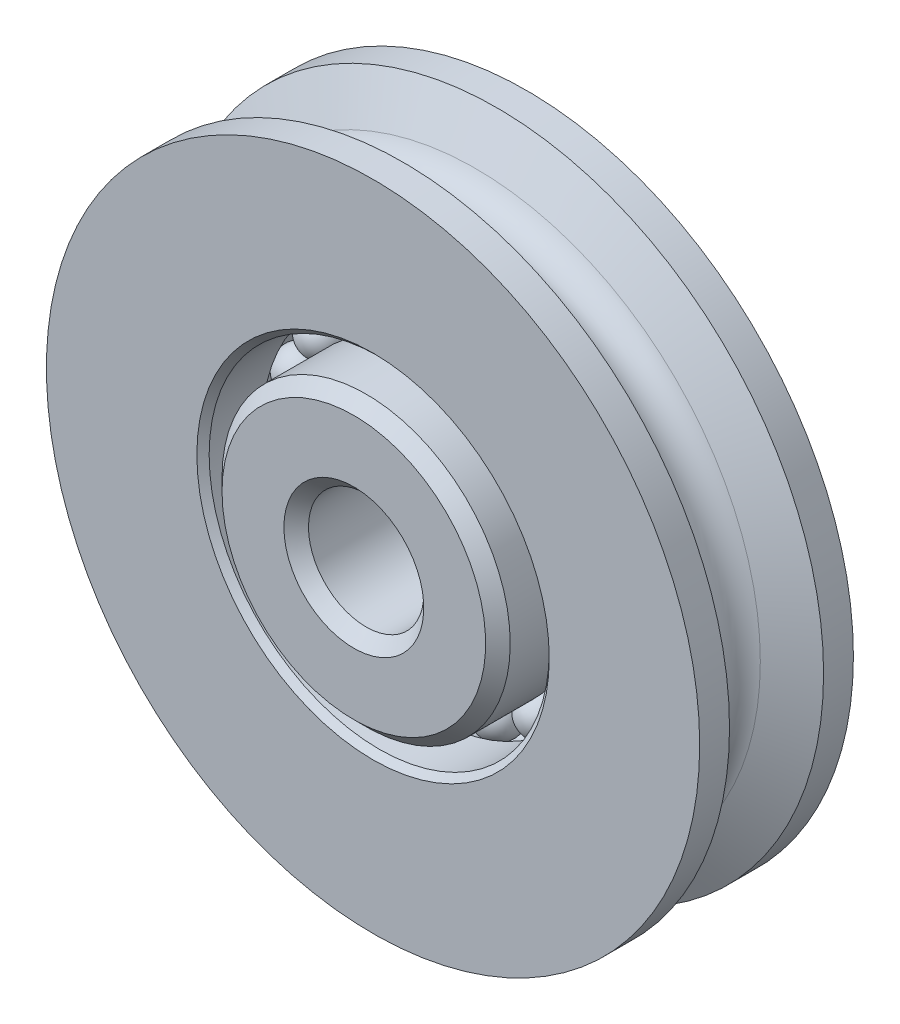
ISO-10303-21;
HEADER;
FILE_DESCRIPTION(('STEP AP214'),'2;1');
FILE_NAME('part.step','',(''),(''),'','','');
FILE_SCHEMA(('AUTOMOTIVE_DESIGN { 1 0 10303 214 1 1 1 1 }'));
ENDSEC;
DATA;
#1=APPLICATION_CONTEXT('core data for automotive mechanical design processes');
#2=APPLICATION_PROTOCOL_DEFINITION('international standard','automotive_design',2000,#1);
#3=PRODUCT_CONTEXT('',#1,'mechanical');
#4=PRODUCT('Part','Part','',(#3));
#5=PRODUCT_RELATED_PRODUCT_CATEGORY('part','',(#4));
#6=PRODUCT_DEFINITION_FORMATION('','',#4);
#7=PRODUCT_DEFINITION_CONTEXT('part definition',#1,'design');
#8=PRODUCT_DEFINITION('design','',#6,#7);
#9=PRODUCT_DEFINITION_SHAPE('','',#8);
#10=(LENGTH_UNIT() NAMED_UNIT(*) SI_UNIT(.MILLI.,.METRE.));
#11=(NAMED_UNIT(*) PLANE_ANGLE_UNIT() SI_UNIT($,.RADIAN.));
#12=(NAMED_UNIT(*) SI_UNIT($,.STERADIAN.) SOLID_ANGLE_UNIT());
#13=UNCERTAINTY_MEASURE_WITH_UNIT(LENGTH_MEASURE(1.E-05),#10,'distance_accuracy_value','');
#14=(GEOMETRIC_REPRESENTATION_CONTEXT(3) GLOBAL_UNCERTAINTY_ASSIGNED_CONTEXT((#13)) GLOBAL_UNIT_ASSIGNED_CONTEXT((#10,
#11,#12)) REPRESENTATION_CONTEXT('',''));
#15=CARTESIAN_POINT('',(0.,0.,0.));
#16=DIRECTION('',(0.,0.,1.));
#17=DIRECTION('',(1.,0.,0.));
#18=AXIS2_PLACEMENT_3D('',#15,#16,#17);
#19=CARTESIAN_POINT('',(2.00518230615573,6.17131657269088,0.));
#20=DIRECTION('',(0.309016994374935,0.951056516295158,0.));
#21=DIRECTION('',(0.,0.,-1.));
#22=AXIS2_PLACEMENT_3D('',#19,#20,#21);
#23=SPHERICAL_SURFACE('',#22,0.89296875);
#24=CARTESIAN_POINT('',(2.28112482535147,7.02058032122632,0.));
#25=VERTEX_POINT('',#24);
#26=VERTEX_LOOP('',#25);
#27=FACE_BOUND('',#26,.T.);
#28=ADVANCED_FACE('F39',(#27),#23,.T.);
#29=CLOSED_SHELL('',(#28));
#30=MANIFOLD_SOLID_BREP('B2',#29);
#31=CARTESIAN_POINT('',(3.81408339725839,5.24963543115586,0.));
#32=DIRECTION('',(0.587785252292462,0.809016994374955,0.));
#33=DIRECTION('',(0.,0.,-1.));
#34=AXIS2_PLACEMENT_3D('',#31,#32,#33);
#35=SPHERICAL_SURFACE('',#34,0.89296875);
#36=CARTESIAN_POINT('',(4.33895725926642,5.97206232535162,0.));
#37=VERTEX_POINT('',#36);
#38=VERTEX_LOOP('',#37);
#39=FACE_BOUND('',#38,.T.);
#40=ADVANCED_FACE('F57',(#39),#35,.T.);
#41=CLOSED_SHELL('',(#40));
#42=MANIFOLD_SOLID_BREP('B6',#41);
#43=CARTESIAN_POINT('',(5.24963543115576,3.81408339725852,0.));
#44=DIRECTION('',(0.80901699437494,0.587785252292483,0.));
#45=DIRECTION('',(0.,0.,-1.));
#46=AXIS2_PLACEMENT_3D('',#43,#44,#45);
#47=SPHERICAL_SURFACE('',#46,0.89296875);
#48=CARTESIAN_POINT('',(5.97206232535151,4.33895725926657,0.));
#49=VERTEX_POINT('',#48);
#50=VERTEX_LOOP('',#49);
#51=FACE_BOUND('',#50,.T.);
#52=ADVANCED_FACE('F75',(#51),#47,.T.);
#53=CLOSED_SHELL('',(#52));
#54=MANIFOLD_SOLID_BREP('B35',#53);
#55=CARTESIAN_POINT('',(6.17131657269083,2.00518230615588,0.));
#56=DIRECTION('',(0.95105651629515,0.309016994374958,0.));
#57=DIRECTION('',(0.,0.,-1.));
#58=AXIS2_PLACEMENT_3D('',#55,#56,#57);
#59=SPHERICAL_SURFACE('',#58,0.89296875);
#60=CARTESIAN_POINT('',(7.02058032122626,2.28112482535164,0.));
#61=VERTEX_POINT('',#60);
#62=VERTEX_LOOP('',#61);
#63=FACE_BOUND('',#62,.T.);
#64=ADVANCED_FACE('F93',(#63),#59,.T.);
#65=CLOSED_SHELL('',(#64));
#66=MANIFOLD_SOLID_BREP('B53',#65);
#67=CARTESIAN_POINT('',(6.48890625,0.,0.));
#68=DIRECTION('',(1.,0.,0.));
#69=DIRECTION('',(0.,0.,-1.));
#70=AXIS2_PLACEMENT_3D('',#67,#68,#69);
#71=SPHERICAL_SURFACE('',#70,0.89296875);
#72=CARTESIAN_POINT('',(7.381875,0.,0.));
#73=VERTEX_POINT('',#72);
#74=VERTEX_LOOP('',#73);
#75=FACE_BOUND('',#74,.T.);
#76=ADVANCED_FACE('F111',(#75),#71,.T.);
#77=CLOSED_SHELL('',(#76));
#78=MANIFOLD_SOLID_BREP('B71',#77);
#79=CARTESIAN_POINT('',(6.17131657269087,-2.00518230615575,0.));
#80=DIRECTION('',(0.951056516295157,-0.309016994374938,0.));
#81=DIRECTION('',(0.,0.,-1.));
#82=AXIS2_PLACEMENT_3D('',#79,#80,#81);
#83=SPHERICAL_SURFACE('',#82,0.89296875);
#84=CARTESIAN_POINT('',(7.02058032122631,-2.2811248253515,0.));
#85=VERTEX_POINT('',#84);
#86=VERTEX_LOOP('',#85);
#87=FACE_BOUND('',#86,.T.);
#88=ADVANCED_FACE('F129',(#87),#83,.T.);
#89=CLOSED_SHELL('',(#88));
#90=MANIFOLD_SOLID_BREP('B89',#89);
#91=CARTESIAN_POINT('',(5.24963543115585,-3.81408339725841,0.));
#92=DIRECTION('',(0.809016994374953,-0.587785252292465,0.));
#93=DIRECTION('',(0.,0.,-1.));
#94=AXIS2_PLACEMENT_3D('',#91,#92,#93);
#95=SPHERICAL_SURFACE('',#94,0.89296875);
#96=CARTESIAN_POINT('',(5.97206232535161,-4.33895725926644,0.));
#97=VERTEX_POINT('',#96);
#98=VERTEX_LOOP('',#97);
#99=FACE_BOUND('',#98,.T.);
#100=ADVANCED_FACE('F147',(#99),#95,.T.);
#101=CLOSED_SHELL('',(#100));
#102=MANIFOLD_SOLID_BREP('B107',#101);
#103=CARTESIAN_POINT('',(3.8140833972585,-5.24963543115578,0.));
#104=DIRECTION('',(0.58778525229248,-0.809016994374942,0.));
#105=DIRECTION('',(0.,0.,-1.));
#106=AXIS2_PLACEMENT_3D('',#103,#104,#105);
#107=SPHERICAL_SURFACE('',#106,0.89296875);
#108=CARTESIAN_POINT('',(4.33895725926655,-5.97206232535153,0.));
#109=VERTEX_POINT('',#108);
#110=VERTEX_LOOP('',#109);
#111=FACE_BOUND('',#110,.T.);
#112=ADVANCED_FACE('F165',(#111),#107,.T.);
#113=CLOSED_SHELL('',(#112));
#114=MANIFOLD_SOLID_BREP('B125',#113);
#115=CARTESIAN_POINT('',(2.00518230615586,-6.17131657269083,0.));
#116=DIRECTION('',(0.309016994374955,-0.951056516295151,0.));
#117=DIRECTION('',(0.,0.,-1.));
#118=AXIS2_PLACEMENT_3D('',#115,#116,#117);
#119=SPHERICAL_SURFACE('',#118,0.89296875);
#120=CARTESIAN_POINT('',(2.28112482535162,-7.02058032122627,0.));
#121=VERTEX_POINT('',#120);
#122=VERTEX_LOOP('',#121);
#123=FACE_BOUND('',#122,.T.);
#124=ADVANCED_FACE('F183',(#123),#119,.T.);
#125=CLOSED_SHELL('',(#124));
#126=MANIFOLD_SOLID_BREP('B143',#125);
#127=CARTESIAN_POINT('',(0.,-6.48890625,0.));
#128=DIRECTION('',(0.,-1.,0.));
#129=DIRECTION('',(0.,0.,-1.));
#130=AXIS2_PLACEMENT_3D('',#127,#128,#129);
#131=SPHERICAL_SURFACE('',#130,0.89296875);
#132=CARTESIAN_POINT('',(0.,-7.381875,0.));
#133=VERTEX_POINT('',#132);
#134=VERTEX_LOOP('',#133);
#135=FACE_BOUND('',#134,.T.);
#136=ADVANCED_FACE('F201',(#135),#131,.T.);
#137=CLOSED_SHELL('',(#136));
#138=MANIFOLD_SOLID_BREP('B161',#137);
#139=CARTESIAN_POINT('',(-2.00518230615577,-6.17131657269086,0.));
#140=DIRECTION('',(-0.309016994374941,-0.951056516295156,0.));
#141=DIRECTION('',(0.,0.,-1.));
#142=AXIS2_PLACEMENT_3D('',#139,#140,#141);
#143=SPHERICAL_SURFACE('',#142,0.89296875);
#144=CARTESIAN_POINT('',(-2.28112482535152,-7.0205803212263,0.));
#145=VERTEX_POINT('',#144);
#146=VERTEX_LOOP('',#145);
#147=FACE_BOUND('',#146,.T.);
#148=ADVANCED_FACE('F219',(#147),#143,.T.);
#149=CLOSED_SHELL('',(#148));
#150=MANIFOLD_SOLID_BREP('B179',#149);
#151=CARTESIAN_POINT('',(-3.81408339725843,-5.24963543115583,0.));
#152=DIRECTION('',(-0.587785252292469,-0.809016994374951,0.));
#153=DIRECTION('',(0.,0.,-1.));
#154=AXIS2_PLACEMENT_3D('',#151,#152,#153);
#155=SPHERICAL_SURFACE('',#154,0.89296875);
#156=CARTESIAN_POINT('',(-4.33895725926647,-5.97206232535159,0.));
#157=VERTEX_POINT('',#156);
#158=VERTEX_LOOP('',#157);
#159=FACE_BOUND('',#158,.T.);
#160=ADVANCED_FACE('F237',(#159),#155,.T.);
#161=CLOSED_SHELL('',(#160));
#162=MANIFOLD_SOLID_BREP('B197',#161);
#163=CARTESIAN_POINT('',(-5.24963543115579,-3.81408339725848,0.));
#164=DIRECTION('',(-0.809016994374945,-0.587785252292477,0.));
#165=DIRECTION('',(0.,0.,-1.));
#166=AXIS2_PLACEMENT_3D('',#163,#164,#165);
#167=SPHERICAL_SURFACE('',#166,0.89296875);
#168=CARTESIAN_POINT('',(-5.97206232535154,-4.33895725926653,0.));
#169=VERTEX_POINT('',#168);
#170=VERTEX_LOOP('',#169);
#171=FACE_BOUND('',#170,.T.);
#172=ADVANCED_FACE('F255',(#171),#167,.T.);
#173=CLOSED_SHELL('',(#172));
#174=MANIFOLD_SOLID_BREP('B215',#173);
#175=CARTESIAN_POINT('',(-6.17131657269084,-2.00518230615584,0.));
#176=DIRECTION('',(-0.951056516295152,-0.309016994374952,0.));
#177=DIRECTION('',(0.,0.,-1.));
#178=AXIS2_PLACEMENT_3D('',#175,#176,#177);
#179=SPHERICAL_SURFACE('',#178,0.89296875);
#180=CARTESIAN_POINT('',(-7.02058032122628,-2.2811248253516,0.));
#181=VERTEX_POINT('',#180);
#182=VERTEX_LOOP('',#181);
#183=FACE_BOUND('',#182,.T.);
#184=ADVANCED_FACE('F273',(#183),#179,.T.);
#185=CLOSED_SHELL('',(#184));
#186=MANIFOLD_SOLID_BREP('B233',#185);
#187=CARTESIAN_POINT('',(-6.48890625,0.,0.));
#188=DIRECTION('',(-1.,0.,0.));
#189=DIRECTION('',(0.,0.,-1.));
#190=AXIS2_PLACEMENT_3D('',#187,#188,#189);
#191=SPHERICAL_SURFACE('',#190,0.89296875);
#192=CARTESIAN_POINT('',(-7.381875,0.,0.));
#193=VERTEX_POINT('',#192);
#194=VERTEX_LOOP('',#193);
#195=FACE_BOUND('',#194,.T.);
#196=ADVANCED_FACE('F291',(#195),#191,.T.);
#197=CLOSED_SHELL('',(#196));
#198=MANIFOLD_SOLID_BREP('B251',#197);
#199=CARTESIAN_POINT('',(-6.17131657269086,2.00518230615579,0.));
#200=DIRECTION('',(-0.951056516295155,0.309016994374945,0.));
#201=DIRECTION('',(0.,0.,-1.));
#202=AXIS2_PLACEMENT_3D('',#199,#200,#201);
#203=SPHERICAL_SURFACE('',#202,0.89296875);
#204=CARTESIAN_POINT('',(-7.02058032122629,2.28112482535155,0.));
#205=VERTEX_POINT('',#204);
#206=VERTEX_LOOP('',#205);
#207=FACE_BOUND('',#206,.T.);
#208=ADVANCED_FACE('F309',(#207),#203,.T.);
#209=CLOSED_SHELL('',(#208));
#210=MANIFOLD_SOLID_BREP('B269',#209);
#211=CARTESIAN_POINT('',(-5.24963543115582,3.81408339725844,0.));
#212=DIRECTION('',(-0.809016994374949,0.587785252292471,0.));
#213=DIRECTION('',(0.,0.,-1.));
#214=AXIS2_PLACEMENT_3D('',#211,#212,#213);
#215=SPHERICAL_SURFACE('',#214,0.89296875);
#216=CARTESIAN_POINT('',(-5.97206232535157,4.33895725926649,0.));
#217=VERTEX_POINT('',#216);
#218=VERTEX_LOOP('',#217);
#219=FACE_BOUND('',#218,.T.);
#220=ADVANCED_FACE('F327',(#219),#215,.T.);
#221=CLOSED_SHELL('',(#220));
#222=MANIFOLD_SOLID_BREP('B287',#221);
#223=CARTESIAN_POINT('',(-3.81408339725846,5.24963543115581,0.));
#224=DIRECTION('',(-0.587785252292474,0.809016994374947,0.));
#225=DIRECTION('',(0.,0.,-1.));
#226=AXIS2_PLACEMENT_3D('',#223,#224,#225);
#227=SPHERICAL_SURFACE('',#226,0.89296875);
#228=CARTESIAN_POINT('',(-4.33895725926651,5.97206232535156,0.));
#229=VERTEX_POINT('',#228);
#230=VERTEX_LOOP('',#229);
#231=FACE_BOUND('',#230,.T.);
#232=ADVANCED_FACE('F345',(#231),#227,.T.);
#233=CLOSED_SHELL('',(#232));
#234=MANIFOLD_SOLID_BREP('B305',#233);
#235=CARTESIAN_POINT('',(-2.00518230615582,6.17131657269085,0.));
#236=DIRECTION('',(-0.309016994374948,0.951056516295154,0.));
#237=DIRECTION('',(0.,0.,-1.));
#238=AXIS2_PLACEMENT_3D('',#235,#236,#237);
#239=SPHERICAL_SURFACE('',#238,0.89296875);
#240=CARTESIAN_POINT('',(-2.28112482535157,7.02058032122629,0.));
#241=VERTEX_POINT('',#240);
#242=VERTEX_LOOP('',#241);
#243=FACE_BOUND('',#242,.T.);
#244=ADVANCED_FACE('F363',(#243),#239,.T.);
#245=CLOSED_SHELL('',(#244));
#246=MANIFOLD_SOLID_BREP('B323',#245);
#247=CARTESIAN_POINT('',(0.,6.48890625,0.));
#248=DIRECTION('',(0.,1.,0.));
#249=DIRECTION('',(0.,0.,-1.));
#250=AXIS2_PLACEMENT_3D('',#247,#248,#249);
#251=SPHERICAL_SURFACE('',#250,0.89296875);
#252=CARTESIAN_POINT('',(0.,7.381875,0.));
#253=VERTEX_POINT('',#252);
#254=VERTEX_LOOP('',#253);
#255=FACE_BOUND('',#254,.T.);
#256=ADVANCED_FACE('F383',(#255),#251,.T.);
#257=CLOSED_SHELL('',(#256));
#258=MANIFOLD_SOLID_BREP('B341',#257);
#259=CARTESIAN_POINT('',(0.,5.953125,3.96875));
#260=DIRECTION('',(0.,0.,-1.));
#261=DIRECTION('',(-1.,0.,0.));
#262=AXIS2_PLACEMENT_3D('',#259,#260,#261);
#263=PLANE('',#262);
#264=CARTESIAN_POINT('',(0.,0.,3.96875));
#265=DIRECTION('',(0.,0.,-1.));
#266=DIRECTION('',(-1.,0.,0.));
#267=AXIS2_PLACEMENT_3D('',#264,#265,#266);
#268=CIRCLE('',#267,5.445125);
#269=CARTESIAN_POINT('',(-5.445125,0.,3.96875));
#270=VERTEX_POINT('',#269);
#271=EDGE_CURVE('E409',#270,#270,#268,.F.);
#272=ORIENTED_EDGE('',*,*,#271,.T.);
#273=EDGE_LOOP('',(#272));
#274=FACE_BOUND('',#273,.T.);
#275=CARTESIAN_POINT('',(0.,0.,3.96875));
#276=DIRECTION('',(0.,0.,-1.));
#277=DIRECTION('',(-1.,0.,0.));
#278=AXIS2_PLACEMENT_3D('',#275,#276,#277);
#279=CIRCLE('',#278,2.88925);
#280=CARTESIAN_POINT('',(-2.88925,0.,3.96875));
#281=VERTEX_POINT('',#280);
#282=EDGE_CURVE('E413',#281,#281,#279,.T.);
#283=ORIENTED_EDGE('',*,*,#282,.T.);
#284=EDGE_LOOP('',(#283));
#285=FACE_BOUND('',#284,.T.);
#286=ADVANCED_FACE('F402',(#274,#285),#263,.F.);
#287=CARTESIAN_POINT('',(0.,0.,3.96875));
#288=DIRECTION('',(0.,0.,1.));
#289=DIRECTION('',(1.,0.,0.));
#290=AXIS2_PLACEMENT_3D('',#287,#288,#289);
#291=CYLINDRICAL_SURFACE('',#290,2.38125);
#292=CARTESIAN_POINT('',(0.,0.,-3.46075));
#293=DIRECTION('',(0.,0.,1.));
#294=DIRECTION('',(1.,0.,0.));
#295=AXIS2_PLACEMENT_3D('',#292,#293,#294);
#296=CIRCLE('',#295,2.38125);
#297=CARTESIAN_POINT('',(2.38125,0.,-3.46075));
#298=VERTEX_POINT('',#297);
#299=EDGE_CURVE('E422',#298,#298,#296,.F.);
#300=ORIENTED_EDGE('',*,*,#299,.T.);
#301=EDGE_LOOP('',(#300));
#302=FACE_BOUND('',#301,.T.);
#303=CARTESIAN_POINT('',(0.,0.,3.46075));
#304=DIRECTION('',(0.,0.,-1.));
#305=DIRECTION('',(-1.,0.,0.));
#306=AXIS2_PLACEMENT_3D('',#303,#304,#305);
#307=CIRCLE('',#306,2.38125);
#308=CARTESIAN_POINT('',(-2.38125,0.,3.46075));
#309=VERTEX_POINT('',#308);
#310=EDGE_CURVE('E425',#309,#309,#307,.F.);
#311=ORIENTED_EDGE('',*,*,#310,.T.);
#312=EDGE_LOOP('',(#311));
#313=FACE_BOUND('',#312,.T.);
#314=ADVANCED_FACE('F457',(#302,#313),#291,.F.);
#315=CARTESIAN_POINT('',(0.,5.953125,-3.96875));
#316=DIRECTION('',(0.,0.,1.));
#317=DIRECTION('',(1.,0.,0.));
#318=AXIS2_PLACEMENT_3D('',#315,#316,#317);
#319=PLANE('',#318);
#320=CARTESIAN_POINT('',(0.,0.,-3.96875));
#321=DIRECTION('',(0.,0.,1.));
#322=DIRECTION('',(1.,0.,0.));
#323=AXIS2_PLACEMENT_3D('',#320,#321,#322);
#324=CIRCLE('',#323,2.88925);
#325=CARTESIAN_POINT('',(2.88925,0.,-3.96875));
#326=VERTEX_POINT('',#325);
#327=EDGE_CURVE('E428',#326,#326,#324,.T.);
#328=ORIENTED_EDGE('',*,*,#327,.T.);
#329=EDGE_LOOP('',(#328));
#330=FACE_BOUND('',#329,.T.);
#331=CARTESIAN_POINT('',(0.,0.,-3.96875));
#332=DIRECTION('',(0.,0.,1.));
#333=DIRECTION('',(1.,0.,0.));
#334=AXIS2_PLACEMENT_3D('',#331,#332,#333);
#335=CIRCLE('',#334,5.44512499999999);
#336=CARTESIAN_POINT('',(5.44512499999999,0.,-3.96875));
#337=VERTEX_POINT('',#336);
#338=EDGE_CURVE('E431',#337,#337,#335,.F.);
#339=ORIENTED_EDGE('',*,*,#338,.T.);
#340=EDGE_LOOP('',(#339));
#341=FACE_BOUND('',#340,.T.);
#342=ADVANCED_FACE('F451',(#330,#341),#319,.F.);
#343=CARTESIAN_POINT('',(0.,0.,3.96875));
#344=DIRECTION('',(0.,0.,1.));
#345=DIRECTION('',(1.,0.,0.));
#346=AXIS2_PLACEMENT_3D('',#343,#344,#345);
#347=CYLINDRICAL_SURFACE('',#346,5.953125);
#348=CARTESIAN_POINT('',(0.,0.,-3.46075));
#349=DIRECTION('',(0.,0.,1.));
#350=DIRECTION('',(1.,0.,0.));
#351=AXIS2_PLACEMENT_3D('',#348,#349,#350);
#352=CIRCLE('',#351,5.953125);
#353=CARTESIAN_POINT('',(5.953125,0.,-3.46075));
#354=VERTEX_POINT('',#353);
#355=EDGE_CURVE('E417',#354,#354,#352,.T.);
#356=ORIENTED_EDGE('',*,*,#355,.T.);
#357=EDGE_LOOP('',(#356));
#358=FACE_BOUND('',#357,.T.);
#359=CARTESIAN_POINT('',(0.,0.,-0.714375));
#360=DIRECTION('',(0.,0.,1.));
#361=DIRECTION('',(1.,0.,0.));
#362=AXIS2_PLACEMENT_3D('',#359,#360,#361);
#363=CIRCLE('',#362,5.953125);
#364=CARTESIAN_POINT('',(5.953125,0.,-0.714375));
#365=VERTEX_POINT('',#364);
#366=EDGE_CURVE('E434',#365,#365,#363,.T.);
#367=ORIENTED_EDGE('',*,*,#366,.F.);
#368=EDGE_LOOP('',(#367));
#369=FACE_BOUND('',#368,.T.);
#370=ADVANCED_FACE('F446',(#358,#369),#347,.T.);
#371=CARTESIAN_POINT('',(0.,0.,0.));
#372=DIRECTION('',(0.,0.,1.));
#373=DIRECTION('',(1.,0.,0.));
#374=AXIS2_PLACEMENT_3D('',#371,#372,#373);
#375=TOROIDAL_SURFACE('',#374,6.48890625,0.89296875);
#376=CARTESIAN_POINT('',(0.,0.,0.714375));
#377=DIRECTION('',(0.,0.,1.));
#378=DIRECTION('',(1.,0.,0.));
#379=AXIS2_PLACEMENT_3D('',#376,#377,#378);
#380=CIRCLE('',#379,5.953125);
#381=CARTESIAN_POINT('',(5.953125,0.,0.714375));
#382=VERTEX_POINT('',#381);
#383=EDGE_CURVE('E437',#382,#382,#380,.T.);
#384=ORIENTED_EDGE('',*,*,#383,.F.);
#385=EDGE_LOOP('',(#384));
#386=FACE_BOUND('',#385,.T.);
#387=ORIENTED_EDGE('',*,*,#366,.T.);
#388=EDGE_LOOP('',(#387));
#389=FACE_BOUND('',#388,.T.);
#390=ADVANCED_FACE('F443',(#386,#389),#375,.F.);
#391=CARTESIAN_POINT('',(0.,0.,3.96875));
#392=DIRECTION('',(0.,0.,1.));
#393=DIRECTION('',(1.,0.,0.));
#394=AXIS2_PLACEMENT_3D('',#391,#392,#393);
#395=CYLINDRICAL_SURFACE('',#394,5.953125);
#396=CARTESIAN_POINT('',(0.,0.,3.46075));
#397=DIRECTION('',(0.,0.,-1.));
#398=DIRECTION('',(-1.,0.,0.));
#399=AXIS2_PLACEMENT_3D('',#396,#397,#398);
#400=CIRCLE('',#399,5.953125);
#401=CARTESIAN_POINT('',(-5.953125,0.,3.46075));
#402=VERTEX_POINT('',#401);
#403=EDGE_CURVE('E382',#402,#402,#400,.T.);
#404=ORIENTED_EDGE('',*,*,#403,.T.);
#405=EDGE_LOOP('',(#404));
#406=FACE_BOUND('',#405,.T.);
#407=ORIENTED_EDGE('',*,*,#383,.T.);
#408=EDGE_LOOP('',(#407));
#409=FACE_BOUND('',#408,.T.);
#410=ADVANCED_FACE('F441',(#406,#409),#395,.T.);
#411=CARTESIAN_POINT('',(0.,0.,-3.96875));
#412=DIRECTION('',(0.,0.,-1.));
#413=DIRECTION('',(-1.,0.,0.));
#414=AXIS2_PLACEMENT_3D('',#411,#412,#413);
#415=CONICAL_SURFACE('',#414,2.88925,0.785398163397447);
#416=ORIENTED_EDGE('',*,*,#299,.F.);
#417=EDGE_LOOP('',(#416));
#418=FACE_BOUND('',#417,.T.);
#419=ORIENTED_EDGE('',*,*,#327,.F.);
#420=EDGE_LOOP('',(#419));
#421=FACE_BOUND('',#420,.T.);
#422=ADVANCED_FACE('F469',(#418,#421),#415,.F.);
#423=CARTESIAN_POINT('',(0.,0.,-3.46075));
#424=DIRECTION('',(0.,0.,1.));
#425=DIRECTION('',(1.,0.,0.));
#426=AXIS2_PLACEMENT_3D('',#423,#424,#425);
#427=CONICAL_SURFACE('',#426,5.953125,0.785398163397452);
#428=ORIENTED_EDGE('',*,*,#338,.F.);
#429=EDGE_LOOP('',(#428));
#430=FACE_BOUND('',#429,.T.);
#431=ORIENTED_EDGE('',*,*,#355,.F.);
#432=EDGE_LOOP('',(#431));
#433=FACE_BOUND('',#432,.T.);
#434=ADVANCED_FACE('F472',(#430,#433),#427,.T.);
#435=CARTESIAN_POINT('',(0.,0.,3.96875));
#436=DIRECTION('',(0.,0.,-1.));
#437=DIRECTION('',(-1.,0.,0.));
#438=AXIS2_PLACEMENT_3D('',#435,#436,#437);
#439=CONICAL_SURFACE('',#438,5.445125,0.785398163397447);
#440=ORIENTED_EDGE('',*,*,#403,.F.);
#441=EDGE_LOOP('',(#440));
#442=FACE_BOUND('',#441,.T.);
#443=ORIENTED_EDGE('',*,*,#271,.F.);
#444=EDGE_LOOP('',(#443));
#445=FACE_BOUND('',#444,.T.);
#446=ADVANCED_FACE('F475',(#442,#445),#439,.T.);
#447=CARTESIAN_POINT('',(0.,0.,3.46075));
#448=DIRECTION('',(0.,0.,1.));
#449=DIRECTION('',(1.,0.,0.));
#450=AXIS2_PLACEMENT_3D('',#447,#448,#449);
#451=CONICAL_SURFACE('',#450,2.38125,0.785398163397445);
#452=ORIENTED_EDGE('',*,*,#282,.F.);
#453=EDGE_LOOP('',(#452));
#454=FACE_BOUND('',#453,.T.);
#455=ORIENTED_EDGE('',*,*,#310,.F.);
#456=EDGE_LOOP('',(#455));
#457=FACE_BOUND('',#456,.T.);
#458=ADVANCED_FACE('F404',(#454,#457),#451,.F.);
#459=CLOSED_SHELL('',(#286,#314,#342,#370,#390,#410,#422,#434,#446,#458));
#460=MANIFOLD_SOLID_BREP('B359',#459);
#461=CARTESIAN_POINT('',(0.,0.,0.));
#462=DIRECTION('',(0.,0.,1.));
#463=DIRECTION('',(1.,0.,0.));
#464=AXIS2_PLACEMENT_3D('',#461,#462,#463);
#465=TOROIDAL_SURFACE('',#464,12.303125,1.190625);
#466=CARTESIAN_POINT('',(0.,0.,1.06081086983107));
#467=DIRECTION('',(0.,0.,1.));
#468=DIRECTION('',(1.,0.,0.));
#469=AXIS2_PLACEMENT_3D('',#466,#467,#468);
#470=CIRCLE('',#469,11.7625066604357);
#471=CARTESIAN_POINT('',(11.7625066604357,0.,1.06081086983107));
#472=VERTEX_POINT('',#471);
#473=EDGE_CURVE('E573',#472,#472,#470,.T.);
#474=ORIENTED_EDGE('',*,*,#473,.F.);
#475=EDGE_LOOP('',(#474));
#476=FACE_BOUND('',#475,.T.);
#477=CARTESIAN_POINT('',(0.,0.,-1.06081086983107));
#478=DIRECTION('',(0.,0.,1.));
#479=DIRECTION('',(1.,0.,0.));
#480=AXIS2_PLACEMENT_3D('',#477,#478,#479);
#481=CIRCLE('',#480,11.7625066604357);
#482=CARTESIAN_POINT('',(11.7625066604357,0.,-1.06081086983107));
#483=VERTEX_POINT('',#482);
#484=EDGE_CURVE('E594',#483,#483,#481,.T.);
#485=ORIENTED_EDGE('',*,*,#484,.T.);
#486=EDGE_LOOP('',(#485));
#487=FACE_BOUND('',#486,.T.);
#488=ADVANCED_FACE('F553',(#476,#487),#465,.F.);
#489=CARTESIAN_POINT('',(0.,0.,1.06081086983107));
#490=DIRECTION('',(0.,0.,1.));
#491=DIRECTION('',(1.,0.,0.));
#492=AXIS2_PLACEMENT_3D('',#489,#490,#491);
#493=CONICAL_SURFACE('',#492,11.7625066604357,1.0994764538701);
#494=CARTESIAN_POINT('',(0.,0.,1.9431));
#495=DIRECTION('',(0.,0.,1.));
#496=DIRECTION('',(1.,0.,0.));
#497=AXIS2_PLACEMENT_3D('',#494,#495,#496);
#498=CIRCLE('',#497,13.49375);
#499=CARTESIAN_POINT('',(13.49375,0.,1.9431));
#500=VERTEX_POINT('',#499);
#501=EDGE_CURVE('E576',#500,#500,#498,.T.);
#502=ORIENTED_EDGE('',*,*,#501,.F.);
#503=EDGE_LOOP('',(#502));
#504=FACE_BOUND('',#503,.T.);
#505=ORIENTED_EDGE('',*,*,#473,.T.);
#506=EDGE_LOOP('',(#505));
#507=FACE_BOUND('',#506,.T.);
#508=ADVANCED_FACE('F624',(#504,#507),#493,.T.);
#509=CARTESIAN_POINT('',(0.,0.,3.96875));
#510=DIRECTION('',(0.,0.,1.));
#511=DIRECTION('',(1.,0.,0.));
#512=AXIS2_PLACEMENT_3D('',#509,#510,#511);
#513=CYLINDRICAL_SURFACE('',#512,13.49375);
#514=CARTESIAN_POINT('',(0.,0.,3.175));
#515=DIRECTION('',(0.,0.,1.));
#516=DIRECTION('',(1.,0.,0.));
#517=AXIS2_PLACEMENT_3D('',#514,#515,#516);
#518=CIRCLE('',#517,13.49375);
#519=CARTESIAN_POINT('',(13.49375,0.,3.175));
#520=VERTEX_POINT('',#519);
#521=EDGE_CURVE('E579',#520,#520,#518,.T.);
#522=ORIENTED_EDGE('',*,*,#521,.F.);
#523=EDGE_LOOP('',(#522));
#524=FACE_BOUND('',#523,.T.);
#525=ORIENTED_EDGE('',*,*,#501,.T.);
#526=EDGE_LOOP('',(#525));
#527=FACE_BOUND('',#526,.T.);
#528=ADVANCED_FACE('F630',(#524,#527),#513,.T.);
#529=CARTESIAN_POINT('',(0.,7.0246875,3.175));
#530=DIRECTION('',(0.,0.,-1.));
#531=DIRECTION('',(-1.,0.,0.));
#532=AXIS2_PLACEMENT_3D('',#529,#530,#531);
#533=PLANE('',#532);
#534=CARTESIAN_POINT('',(0.,0.,3.175));
#535=DIRECTION('',(0.,0.,-1.));
#536=DIRECTION('',(-1.,0.,0.));
#537=AXIS2_PLACEMENT_3D('',#534,#535,#536);
#538=CIRCLE('',#537,7.2786875);
#539=CARTESIAN_POINT('',(-7.2786875,0.,3.175));
#540=VERTEX_POINT('',#539);
#541=EDGE_CURVE('E401',#540,#540,#538,.T.);
#542=ORIENTED_EDGE('',*,*,#541,.T.);
#543=EDGE_LOOP('',(#542));
#544=FACE_BOUND('',#543,.T.);
#545=ORIENTED_EDGE('',*,*,#521,.T.);
#546=EDGE_LOOP('',(#545));
#547=FACE_BOUND('',#546,.T.);
#548=ADVANCED_FACE('F654',(#544,#547),#533,.F.);
#549=CARTESIAN_POINT('',(0.,0.,3.96875));
#550=DIRECTION('',(0.,0.,1.));
#551=DIRECTION('',(1.,0.,0.));
#552=AXIS2_PLACEMENT_3D('',#549,#550,#551);
#553=CYLINDRICAL_SURFACE('',#552,7.0246875);
#554=CARTESIAN_POINT('',(0.,0.,2.921));
#555=DIRECTION('',(0.,0.,-1.));
#556=DIRECTION('',(-1.,0.,0.));
#557=AXIS2_PLACEMENT_3D('',#554,#555,#556);
#558=CIRCLE('',#557,7.0246875);
#559=CARTESIAN_POINT('',(-7.0246875,0.,2.921));
#560=VERTEX_POINT('',#559);
#561=EDGE_CURVE('E560',#560,#560,#558,.F.);
#562=ORIENTED_EDGE('',*,*,#561,.T.);
#563=EDGE_LOOP('',(#562));
#564=FACE_BOUND('',#563,.T.);
#565=CARTESIAN_POINT('',(0.,0.,0.714375));
#566=DIRECTION('',(0.,0.,1.));
#567=DIRECTION('',(1.,0.,0.));
#568=AXIS2_PLACEMENT_3D('',#565,#566,#567);
#569=CIRCLE('',#568,7.0246875);
#570=CARTESIAN_POINT('',(7.0246875,0.,0.714375));
#571=VERTEX_POINT('',#570);
#572=EDGE_CURVE('E582',#571,#571,#569,.T.);
#573=ORIENTED_EDGE('',*,*,#572,.F.);
#574=EDGE_LOOP('',(#573));
#575=FACE_BOUND('',#574,.T.);
#576=ADVANCED_FACE('F649',(#564,#575),#553,.F.);
#577=CARTESIAN_POINT('',(0.,0.,0.));
#578=DIRECTION('',(0.,0.,1.));
#579=DIRECTION('',(1.,0.,0.));
#580=AXIS2_PLACEMENT_3D('',#577,#578,#579);
#581=TOROIDAL_SURFACE('',#580,6.48890625,0.89296875);
#582=CARTESIAN_POINT('',(0.,0.,-0.714375));
#583=DIRECTION('',(0.,0.,1.));
#584=DIRECTION('',(1.,0.,0.));
#585=AXIS2_PLACEMENT_3D('',#582,#583,#584);
#586=CIRCLE('',#585,7.0246875);
#587=CARTESIAN_POINT('',(7.0246875,0.,-0.714375));
#588=VERTEX_POINT('',#587);
#589=EDGE_CURVE('E585',#588,#588,#586,.T.);
#590=ORIENTED_EDGE('',*,*,#589,.F.);
#591=EDGE_LOOP('',(#590));
#592=FACE_BOUND('',#591,.T.);
#593=ORIENTED_EDGE('',*,*,#572,.T.);
#594=EDGE_LOOP('',(#593));
#595=FACE_BOUND('',#594,.T.);
#596=ADVANCED_FACE('F620',(#592,#595),#581,.F.);
#597=CARTESIAN_POINT('',(0.,0.,3.96875));
#598=DIRECTION('',(0.,0.,1.));
#599=DIRECTION('',(1.,0.,0.));
#600=AXIS2_PLACEMENT_3D('',#597,#598,#599);
#601=CYLINDRICAL_SURFACE('',#600,7.0246875);
#602=CARTESIAN_POINT('',(0.,0.,-2.921));
#603=DIRECTION('',(0.,0.,1.));
#604=DIRECTION('',(1.,0.,0.));
#605=AXIS2_PLACEMENT_3D('',#602,#603,#604);
#606=CIRCLE('',#605,7.0246875);
#607=CARTESIAN_POINT('',(7.0246875,0.,-2.921));
#608=VERTEX_POINT('',#607);
#609=EDGE_CURVE('E564',#608,#608,#606,.F.);
#610=ORIENTED_EDGE('',*,*,#609,.T.);
#611=EDGE_LOOP('',(#610));
#612=FACE_BOUND('',#611,.T.);
#613=ORIENTED_EDGE('',*,*,#589,.T.);
#614=EDGE_LOOP('',(#613));
#615=FACE_BOUND('',#614,.T.);
#616=ADVANCED_FACE('F614',(#612,#615),#601,.F.);
#617=CARTESIAN_POINT('',(0.,13.49375,-3.175));
#618=DIRECTION('',(0.,0.,1.));
#619=DIRECTION('',(1.,0.,0.));
#620=AXIS2_PLACEMENT_3D('',#617,#618,#619);
#621=PLANE('',#620);
#622=CARTESIAN_POINT('',(0.,0.,-3.175));
#623=DIRECTION('',(0.,0.,1.));
#624=DIRECTION('',(1.,0.,0.));
#625=AXIS2_PLACEMENT_3D('',#622,#623,#624);
#626=CIRCLE('',#625,7.2786875);
#627=CARTESIAN_POINT('',(7.2786875,0.,-3.175));
#628=VERTEX_POINT('',#627);
#629=EDGE_CURVE('E568',#628,#628,#626,.T.);
#630=ORIENTED_EDGE('',*,*,#629,.T.);
#631=EDGE_LOOP('',(#630));
#632=FACE_BOUND('',#631,.T.);
#633=CARTESIAN_POINT('',(0.,0.,-3.175));
#634=DIRECTION('',(0.,0.,1.));
#635=DIRECTION('',(1.,0.,0.));
#636=AXIS2_PLACEMENT_3D('',#633,#634,#635);
#637=CIRCLE('',#636,13.49375);
#638=CARTESIAN_POINT('',(13.49375,0.,-3.175));
#639=VERTEX_POINT('',#638);
#640=EDGE_CURVE('E588',#639,#639,#637,.T.);
#641=ORIENTED_EDGE('',*,*,#640,.F.);
#642=EDGE_LOOP('',(#641));
#643=FACE_BOUND('',#642,.T.);
#644=ADVANCED_FACE('F609',(#632,#643),#621,.F.);
#645=CARTESIAN_POINT('',(0.,0.,3.96875));
#646=DIRECTION('',(0.,0.,1.));
#647=DIRECTION('',(1.,0.,0.));
#648=AXIS2_PLACEMENT_3D('',#645,#646,#647);
#649=CYLINDRICAL_SURFACE('',#648,13.49375);
#650=CARTESIAN_POINT('',(0.,0.,-1.9431));
#651=DIRECTION('',(0.,0.,1.));
#652=DIRECTION('',(1.,0.,0.));
#653=AXIS2_PLACEMENT_3D('',#650,#651,#652);
#654=CIRCLE('',#653,13.49375);
#655=CARTESIAN_POINT('',(13.49375,0.,-1.9431));
#656=VERTEX_POINT('',#655);
#657=EDGE_CURVE('E591',#656,#656,#654,.T.);
#658=ORIENTED_EDGE('',*,*,#657,.F.);
#659=EDGE_LOOP('',(#658));
#660=FACE_BOUND('',#659,.T.);
#661=ORIENTED_EDGE('',*,*,#640,.T.);
#662=EDGE_LOOP('',(#661));
#663=FACE_BOUND('',#662,.T.);
#664=ADVANCED_FACE('F603',(#660,#663),#649,.T.);
#665=CARTESIAN_POINT('',(0.,0.,-1.9431));
#666=DIRECTION('',(0.,0.,-1.));
#667=DIRECTION('',(-1.,0.,0.));
#668=AXIS2_PLACEMENT_3D('',#665,#666,#667);
#669=CONICAL_SURFACE('',#668,13.49375,1.0994764538701);
#670=ORIENTED_EDGE('',*,*,#484,.F.);
#671=EDGE_LOOP('',(#670));
#672=FACE_BOUND('',#671,.T.);
#673=ORIENTED_EDGE('',*,*,#657,.T.);
#674=EDGE_LOOP('',(#673));
#675=FACE_BOUND('',#674,.T.);
#676=ADVANCED_FACE('F599',(#672,#675),#669,.T.);
#677=CARTESIAN_POINT('',(0.,0.,-3.175));
#678=DIRECTION('',(0.,0.,-1.));
#679=DIRECTION('',(-1.,0.,0.));
#680=AXIS2_PLACEMENT_3D('',#677,#678,#679);
#681=CONICAL_SURFACE('',#680,7.2786875,0.785398163397448);
#682=ORIENTED_EDGE('',*,*,#609,.F.);
#683=EDGE_LOOP('',(#682));
#684=FACE_BOUND('',#683,.T.);
#685=ORIENTED_EDGE('',*,*,#629,.F.);
#686=EDGE_LOOP('',(#685));
#687=FACE_BOUND('',#686,.T.);
#688=ADVANCED_FACE('F602',(#684,#687),#681,.F.);
#689=CARTESIAN_POINT('',(0.,0.,2.921));
#690=DIRECTION('',(0.,0.,1.));
#691=DIRECTION('',(1.,0.,0.));
#692=AXIS2_PLACEMENT_3D('',#689,#690,#691);
#693=CONICAL_SURFACE('',#692,7.0246875,0.785398163397448);
#694=ORIENTED_EDGE('',*,*,#541,.F.);
#695=EDGE_LOOP('',(#694));
#696=FACE_BOUND('',#695,.T.);
#697=ORIENTED_EDGE('',*,*,#561,.F.);
#698=EDGE_LOOP('',(#697));
#699=FACE_BOUND('',#698,.T.);
#700=ADVANCED_FACE('F555',(#696,#699),#693,.F.);
#701=CLOSED_SHELL('',(#488,#508,#528,#548,#576,#596,#616,#644,#664,#676,#688,#700));
#702=MANIFOLD_SOLID_BREP('B377',#701);
#703=ADVANCED_BREP_SHAPE_REPRESENTATION('',(#18,#30,#42,#54,#66,#78,#90,#102,#114,#126,#138,
#150,#162,#174,#186,#198,#210,#222,#234,#246,#258,#460,#702),#14);
#704=SHAPE_DEFINITION_REPRESENTATION(#9,#703);
ENDSEC;
END-ISO-10303-21;
